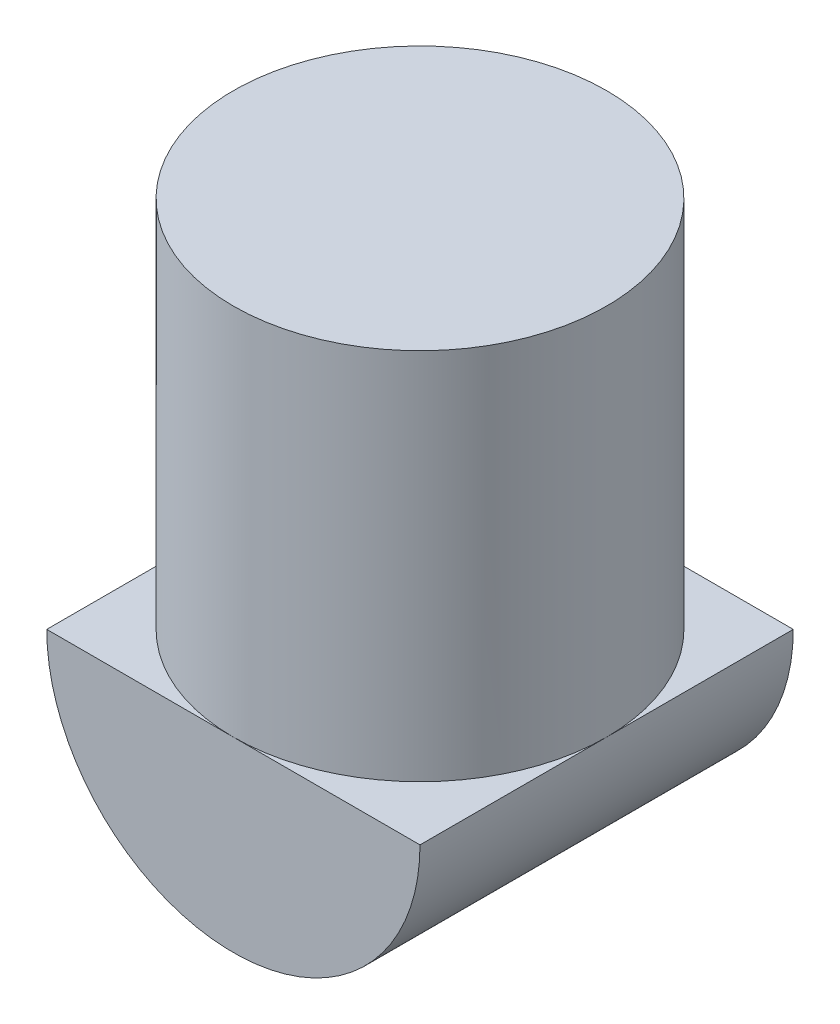
ISO-10303-21;
HEADER;
FILE_DESCRIPTION(('STEP AP214'),'2;1');
FILE_NAME('part.step','',(''),(''),'','','');
FILE_SCHEMA(('AUTOMOTIVE_DESIGN { 1 0 10303 214 1 1 1 1 }'));
ENDSEC;
DATA;
#1=APPLICATION_CONTEXT('core data for automotive mechanical design processes');
#2=APPLICATION_PROTOCOL_DEFINITION('international standard','automotive_design',2000,#1);
#3=PRODUCT_CONTEXT('',#1,'mechanical');
#4=PRODUCT('Part','Part','',(#3));
#5=PRODUCT_RELATED_PRODUCT_CATEGORY('part','',(#4));
#6=PRODUCT_DEFINITION_FORMATION('','',#4);
#7=PRODUCT_DEFINITION_CONTEXT('part definition',#1,'design');
#8=PRODUCT_DEFINITION('design','',#6,#7);
#9=PRODUCT_DEFINITION_SHAPE('','',#8);
#10=(LENGTH_UNIT() NAMED_UNIT(*) SI_UNIT(.MILLI.,.METRE.));
#11=(NAMED_UNIT(*) PLANE_ANGLE_UNIT() SI_UNIT($,.RADIAN.));
#12=(NAMED_UNIT(*) SI_UNIT($,.STERADIAN.) SOLID_ANGLE_UNIT());
#13=UNCERTAINTY_MEASURE_WITH_UNIT(LENGTH_MEASURE(1.E-05),#10,'distance_accuracy_value','');
#14=(GEOMETRIC_REPRESENTATION_CONTEXT(3) GLOBAL_UNCERTAINTY_ASSIGNED_CONTEXT((#13)) GLOBAL_UNIT_ASSIGNED_CONTEXT((#10,
#11,#12)) REPRESENTATION_CONTEXT('',''));
#15=CARTESIAN_POINT('',(0.,0.,0.));
#16=DIRECTION('',(0.,0.,1.));
#17=DIRECTION('',(1.,0.,0.));
#18=AXIS2_PLACEMENT_3D('',#15,#16,#17);
#19=CARTESIAN_POINT('',(0.,0.,16.));
#20=DIRECTION('',(0.,0.,1.));
#21=DIRECTION('',(1.,0.,0.));
#22=AXIS2_PLACEMENT_3D('',#19,#20,#21);
#23=PLANE('',#22);
#24=CARTESIAN_POINT('',(0.,0.,16.));
#25=DIRECTION('',(0.,0.,1.));
#26=DIRECTION('',(1.,0.,0.));
#27=AXIS2_PLACEMENT_3D('',#24,#25,#26);
#28=CIRCLE('',#27,8.);
#29=CARTESIAN_POINT('',(-8.,0.,16.));
#30=VERTEX_POINT('',#29);
#31=CARTESIAN_POINT('',(8.,0.,16.));
#32=VERTEX_POINT('',#31);
#33=EDGE_CURVE('E98',#30,#32,#28,.T.);
#34=ORIENTED_EDGE('',*,*,#33,.T.);
#35=DIRECTION('',(-1.,0.,0.));
#36=VECTOR('',#35,1.);
#37=CARTESIAN_POINT('',(0.,0.,16.));
#38=LINE('',#37,#36);
#39=CARTESIAN_POINT('',(0.,0.,16.));
#40=VERTEX_POINT('',#39);
#41=EDGE_CURVE('E83',#32,#40,#38,.T.);
#42=ORIENTED_EDGE('',*,*,#41,.T.);
#43=EDGE_CURVE('E75',#40,#30,#38,.T.);
#44=ORIENTED_EDGE('',*,*,#43,.T.);
#45=EDGE_LOOP('',(#34,#42,#44));
#46=FACE_BOUND('',#45,.T.);
#47=ADVANCED_FACE('F34',(#46),#23,.T.);
#48=CARTESIAN_POINT('',(0.,0.,0.));
#49=DIRECTION('',(0.,0.,1.));
#50=DIRECTION('',(1.,0.,0.));
#51=AXIS2_PLACEMENT_3D('',#48,#49,#50);
#52=PLANE('',#51);
#53=DIRECTION('',(-1.,0.,0.));
#54=VECTOR('',#53,1.);
#55=CARTESIAN_POINT('',(0.,0.,0.));
#56=LINE('',#55,#54);
#57=CARTESIAN_POINT('',(8.,0.,0.));
#58=VERTEX_POINT('',#57);
#59=CARTESIAN_POINT('',(0.,0.,0.));
#60=VERTEX_POINT('',#59);
#61=EDGE_CURVE('E11',#58,#60,#56,.T.);
#62=ORIENTED_EDGE('',*,*,#61,.F.);
#63=CARTESIAN_POINT('',(0.,0.,0.));
#64=DIRECTION('',(0.,0.,1.));
#65=DIRECTION('',(1.,0.,0.));
#66=AXIS2_PLACEMENT_3D('',#63,#64,#65);
#67=CIRCLE('',#66,8.);
#68=CARTESIAN_POINT('',(-8.,0.,0.));
#69=VERTEX_POINT('',#68);
#70=EDGE_CURVE('E99',#69,#58,#67,.T.);
#71=ORIENTED_EDGE('',*,*,#70,.F.);
#72=EDGE_CURVE('E38',#60,#69,#56,.T.);
#73=ORIENTED_EDGE('',*,*,#72,.F.);
#74=EDGE_LOOP('',(#62,#71,#73));
#75=FACE_BOUND('',#74,.T.);
#76=ADVANCED_FACE('F114',(#75),#52,.F.);
#77=CARTESIAN_POINT('',(0.,0.,16.));
#78=DIRECTION('',(0.,0.,-1.));
#79=DIRECTION('',(-1.,0.,0.));
#80=AXIS2_PLACEMENT_3D('',#77,#78,#79);
#81=CYLINDRICAL_SURFACE('',#80,8.);
#82=ORIENTED_EDGE('',*,*,#70,.T.);
#83=DIRECTION('',(0.,0.,-1.));
#84=VECTOR('',#83,1.);
#85=CARTESIAN_POINT('',(8.,0.,16.));
#86=LINE('',#85,#84);
#87=CARTESIAN_POINT('',(8.,0.,8.));
#88=VERTEX_POINT('',#87);
#89=EDGE_CURVE('E84',#88,#58,#86,.T.);
#90=ORIENTED_EDGE('',*,*,#89,.F.);
#91=DIRECTION('',(0.,0.,-1.));
#92=VECTOR('',#91,1.);
#93=CARTESIAN_POINT('',(8.,0.,16.));
#94=LINE('',#93,#92);
#95=EDGE_CURVE('E96',#32,#88,#94,.T.);
#96=ORIENTED_EDGE('',*,*,#95,.F.);
#97=ORIENTED_EDGE('',*,*,#33,.F.);
#98=DIRECTION('',(0.,0.,-1.));
#99=VECTOR('',#98,1.);
#100=CARTESIAN_POINT('',(-8.,0.,16.));
#101=LINE('',#100,#99);
#102=CARTESIAN_POINT('',(-8.,0.,8.));
#103=VERTEX_POINT('',#102);
#104=EDGE_CURVE('E57',#30,#103,#101,.T.);
#105=ORIENTED_EDGE('',*,*,#104,.T.);
#106=DIRECTION('',(0.,0.,1.));
#107=VECTOR('',#106,1.);
#108=CARTESIAN_POINT('',(-8.,0.,16.));
#109=LINE('',#108,#107);
#110=EDGE_CURVE('E97',#69,#103,#109,.T.);
#111=ORIENTED_EDGE('',*,*,#110,.F.);
#112=EDGE_LOOP('',(#82,#90,#96,#97,#105,#111));
#113=FACE_BOUND('',#112,.T.);
#114=ADVANCED_FACE('F36',(#113),#81,.T.);
#115=CARTESIAN_POINT('',(0.,0.,0.));
#116=DIRECTION('',(0.,1.,0.));
#117=DIRECTION('',(0.,0.,1.));
#118=AXIS2_PLACEMENT_3D('',#115,#116,#117);
#119=PLANE('',#118);
#120=ORIENTED_EDGE('',*,*,#95,.T.);
#121=CARTESIAN_POINT('',(0.,0.,8.));
#122=DIRECTION('',(0.,1.,0.));
#123=DIRECTION('',(0.,0.,1.));
#124=AXIS2_PLACEMENT_3D('',#121,#122,#123);
#125=CIRCLE('',#124,8.);
#126=EDGE_CURVE('E88',#40,#88,#125,.T.);
#127=ORIENTED_EDGE('',*,*,#126,.F.);
#128=ORIENTED_EDGE('',*,*,#41,.F.);
#129=EDGE_LOOP('',(#120,#127,#128));
#130=FACE_BOUND('',#129,.T.);
#131=ADVANCED_FACE('F94',(#130),#119,.T.);
#132=ORIENTED_EDGE('',*,*,#89,.T.);
#133=ORIENTED_EDGE('',*,*,#61,.T.);
#134=EDGE_CURVE('E49',#88,#60,#125,.T.);
#135=ORIENTED_EDGE('',*,*,#134,.F.);
#136=EDGE_LOOP('',(#132,#133,#135));
#137=FACE_BOUND('',#136,.T.);
#138=ADVANCED_FACE('F116',(#137),#119,.T.);
#139=ORIENTED_EDGE('',*,*,#110,.T.);
#140=EDGE_CURVE('E90',#60,#103,#125,.T.);
#141=ORIENTED_EDGE('',*,*,#140,.F.);
#142=ORIENTED_EDGE('',*,*,#72,.T.);
#143=EDGE_LOOP('',(#139,#141,#142));
#144=FACE_BOUND('',#143,.T.);
#145=ADVANCED_FACE('F109',(#144),#119,.T.);
#146=CARTESIAN_POINT('',(0.,0.,8.));
#147=DIRECTION('',(0.,1.,0.));
#148=DIRECTION('',(0.,0.,1.));
#149=AXIS2_PLACEMENT_3D('',#146,#147,#148);
#150=CYLINDRICAL_SURFACE('',#149,8.);
#151=CARTESIAN_POINT('',(0.,16.,8.));
#152=DIRECTION('',(0.,1.,0.));
#153=DIRECTION('',(0.,0.,1.));
#154=AXIS2_PLACEMENT_3D('',#151,#152,#153);
#155=CIRCLE('',#154,8.);
#156=CARTESIAN_POINT('',(0.,16.,16.));
#157=VERTEX_POINT('',#156);
#158=EDGE_CURVE('E91',#157,#157,#155,.T.);
#159=ORIENTED_EDGE('',*,*,#158,.F.);
#160=EDGE_LOOP('',(#159));
#161=FACE_BOUND('',#160,.T.);
#162=ORIENTED_EDGE('',*,*,#126,.T.);
#163=ORIENTED_EDGE('',*,*,#134,.T.);
#164=ORIENTED_EDGE('',*,*,#140,.T.);
#165=EDGE_CURVE('E78',#103,#40,#125,.T.);
#166=ORIENTED_EDGE('',*,*,#165,.T.);
#167=EDGE_LOOP('',(#162,#163,#164,#166));
#168=FACE_BOUND('',#167,.T.);
#169=ADVANCED_FACE('F87',(#161,#168),#150,.T.);
#170=ORIENTED_EDGE('',*,*,#165,.F.);
#171=ORIENTED_EDGE('',*,*,#104,.F.);
#172=ORIENTED_EDGE('',*,*,#43,.F.);
#173=EDGE_LOOP('',(#170,#171,#172));
#174=FACE_BOUND('',#173,.T.);
#175=ADVANCED_FACE('F77',(#174),#119,.T.);
#176=CARTESIAN_POINT('',(-8.,16.,16.));
#177=DIRECTION('',(0.,-1.,0.));
#178=DIRECTION('',(0.,0.,-1.));
#179=AXIS2_PLACEMENT_3D('',#176,#177,#178);
#180=PLANE('',#179);
#181=ORIENTED_EDGE('',*,*,#158,.T.);
#182=EDGE_LOOP('',(#181));
#183=FACE_BOUND('',#182,.T.);
#184=ADVANCED_FACE('F121',(#183),#180,.F.);
#185=CLOSED_SHELL('',(#47,#76,#114,#131,#138,#145,#169,#175,#184));
#186=MANIFOLD_SOLID_BREP('B2',#185);
#187=ADVANCED_BREP_SHAPE_REPRESENTATION('',(#18,#186),#14);
#188=SHAPE_DEFINITION_REPRESENTATION(#9,#187);
ENDSEC;
END-ISO-10303-21;
